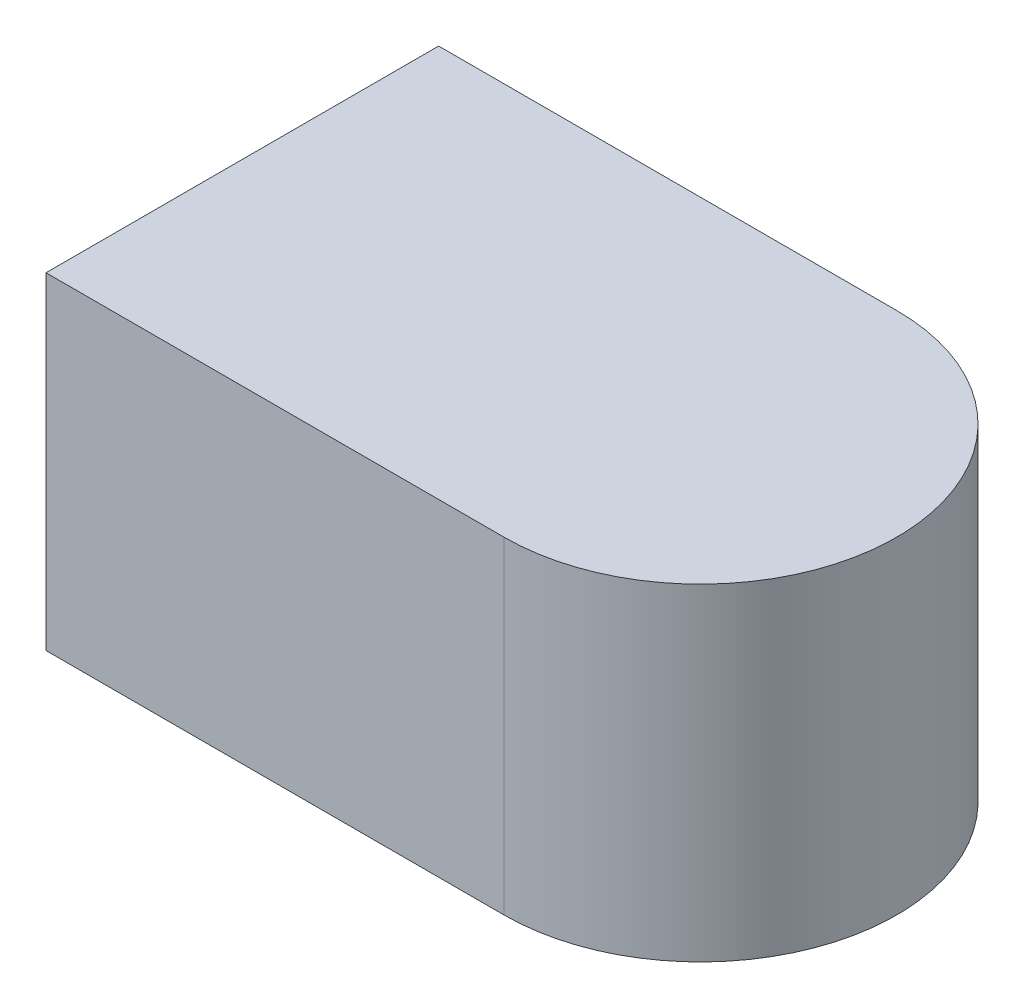
ISO-10303-21;
HEADER;
FILE_DESCRIPTION(('STEP AP214'),'2;1');
FILE_NAME('part.step','',(''),(''),'','','');
FILE_SCHEMA(('AUTOMOTIVE_DESIGN { 1 0 10303 214 1 1 1 1 }'));
ENDSEC;
DATA;
#1=APPLICATION_CONTEXT('core data for automotive mechanical design processes');
#2=APPLICATION_PROTOCOL_DEFINITION('international standard','automotive_design',2000,#1);
#3=PRODUCT_CONTEXT('',#1,'mechanical');
#4=PRODUCT('Part','Part','',(#3));
#5=PRODUCT_RELATED_PRODUCT_CATEGORY('part','',(#4));
#6=PRODUCT_DEFINITION_FORMATION('','',#4);
#7=PRODUCT_DEFINITION_CONTEXT('part definition',#1,'design');
#8=PRODUCT_DEFINITION('design','',#6,#7);
#9=PRODUCT_DEFINITION_SHAPE('','',#8);
#10=(LENGTH_UNIT() NAMED_UNIT(*) SI_UNIT(.MILLI.,.METRE.));
#11=(NAMED_UNIT(*) PLANE_ANGLE_UNIT() SI_UNIT($,.RADIAN.));
#12=(NAMED_UNIT(*) SI_UNIT($,.STERADIAN.) SOLID_ANGLE_UNIT());
#13=UNCERTAINTY_MEASURE_WITH_UNIT(LENGTH_MEASURE(1.E-05),#10,'distance_accuracy_value','');
#14=(GEOMETRIC_REPRESENTATION_CONTEXT(3) GLOBAL_UNCERTAINTY_ASSIGNED_CONTEXT((#13)) GLOBAL_UNIT_ASSIGNED_CONTEXT((#10,
#11,#12)) REPRESENTATION_CONTEXT('',''));
#15=CARTESIAN_POINT('',(0.,0.,0.));
#16=DIRECTION('',(0.,0.,1.));
#17=DIRECTION('',(1.,0.,0.));
#18=AXIS2_PLACEMENT_3D('',#15,#16,#17);
#19=CARTESIAN_POINT('',(0.,0.,0.));
#20=DIRECTION('',(0.,-1.,0.));
#21=DIRECTION('',(-1.,0.,0.));
#22=AXIS2_PLACEMENT_3D('',#19,#20,#21);
#23=PLANE('',#22);
#24=CARTESIAN_POINT('',(-1.47,0.,-1.25));
#25=DIRECTION('',(0.,-1.,0.));
#26=DIRECTION('',(0.,0.,-1.));
#27=AXIS2_PLACEMENT_3D('',#24,#25,#26);
#28=CIRCLE('',#27,0.12);
#29=CARTESIAN_POINT('',(-1.47,0.,-1.37));
#30=VERTEX_POINT('',#29);
#31=CARTESIAN_POINT('',(-1.47,0.,-1.13));
#32=VERTEX_POINT('',#31);
#33=EDGE_CURVE('E11',#30,#32,#28,.T.);
#34=ORIENTED_EDGE('',*,*,#33,.T.);
#35=DIRECTION('',(-1.,0.,0.));
#36=VECTOR('',#35,1.);
#37=CARTESIAN_POINT('',(-1.47,0.,-1.13));
#38=LINE('',#37,#36);
#39=CARTESIAN_POINT('',(-1.75,0.,-1.13));
#40=VERTEX_POINT('',#39);
#41=EDGE_CURVE('E24',#32,#40,#38,.T.);
#42=ORIENTED_EDGE('',*,*,#41,.T.);
#43=DIRECTION('',(0.,0.,-1.));
#44=VECTOR('',#43,1.);
#45=CARTESIAN_POINT('',(-1.75,0.,-1.13));
#46=LINE('',#45,#44);
#47=CARTESIAN_POINT('',(-1.75,0.,-1.37));
#48=VERTEX_POINT('',#47);
#49=EDGE_CURVE('E62',#40,#48,#46,.T.);
#50=ORIENTED_EDGE('',*,*,#49,.T.);
#51=DIRECTION('',(1.,0.,0.));
#52=VECTOR('',#51,1.);
#53=CARTESIAN_POINT('',(-1.75,0.,-1.37));
#54=LINE('',#53,#52);
#55=EDGE_CURVE('E36',#48,#30,#54,.T.);
#56=ORIENTED_EDGE('',*,*,#55,.T.);
#57=EDGE_LOOP('',(#34,#42,#50,#56));
#58=FACE_BOUND('',#57,.T.);
#59=ADVANCED_FACE('F17',(#58),#23,.T.);
#60=CARTESIAN_POINT('',(-1.75,0.,-1.37));
#61=DIRECTION('',(0.,0.,1.));
#62=DIRECTION('',(1.,0.,0.));
#63=AXIS2_PLACEMENT_3D('',#60,#61,#62);
#64=PLANE('',#63);
#65=DIRECTION('',(0.,1.,0.));
#66=VECTOR('',#65,1.);
#67=CARTESIAN_POINT('',(-1.75,0.,-1.37));
#68=LINE('',#67,#66);
#69=CARTESIAN_POINT('',(-1.75,0.2,-1.37));
#70=VERTEX_POINT('',#69);
#71=EDGE_CURVE('E84',#48,#70,#68,.T.);
#72=ORIENTED_EDGE('',*,*,#71,.T.);
#73=DIRECTION('',(1.,0.,0.));
#74=VECTOR('',#73,1.);
#75=CARTESIAN_POINT('',(-1.75,0.2,-1.37));
#76=LINE('',#75,#74);
#77=CARTESIAN_POINT('',(-1.47,0.2,-1.37));
#78=VERTEX_POINT('',#77);
#79=EDGE_CURVE('E74',#70,#78,#76,.T.);
#80=ORIENTED_EDGE('',*,*,#79,.T.);
#81=DIRECTION('',(0.,1.,0.));
#82=VECTOR('',#81,1.);
#83=CARTESIAN_POINT('',(-1.47,0.,-1.37));
#84=LINE('',#83,#82);
#85=EDGE_CURVE('E81',#30,#78,#84,.T.);
#86=ORIENTED_EDGE('',*,*,#85,.F.);
#87=ORIENTED_EDGE('',*,*,#55,.F.);
#88=EDGE_LOOP('',(#72,#80,#86,#87));
#89=FACE_BOUND('',#88,.T.);
#90=ADVANCED_FACE('F91',(#89),#64,.F.);
#91=CARTESIAN_POINT('',(-1.47,0.,-1.25));
#92=DIRECTION('',(0.,-1.,0.));
#93=DIRECTION('',(-1.,0.,0.));
#94=AXIS2_PLACEMENT_3D('',#91,#92,#93);
#95=CYLINDRICAL_SURFACE('',#94,0.12);
#96=ORIENTED_EDGE('',*,*,#85,.T.);
#97=CARTESIAN_POINT('',(-1.47,0.2,-1.25));
#98=DIRECTION('',(0.,-1.,0.));
#99=DIRECTION('',(0.,0.,-1.));
#100=AXIS2_PLACEMENT_3D('',#97,#98,#99);
#101=CIRCLE('',#100,0.12);
#102=CARTESIAN_POINT('',(-1.47,0.2,-1.13));
#103=VERTEX_POINT('',#102);
#104=EDGE_CURVE('E79',#78,#103,#101,.T.);
#105=ORIENTED_EDGE('',*,*,#104,.T.);
#106=DIRECTION('',(0.,1.,0.));
#107=VECTOR('',#106,1.);
#108=CARTESIAN_POINT('',(-1.47,0.,-1.13));
#109=LINE('',#108,#107);
#110=EDGE_CURVE('E68',#32,#103,#109,.T.);
#111=ORIENTED_EDGE('',*,*,#110,.F.);
#112=ORIENTED_EDGE('',*,*,#33,.F.);
#113=EDGE_LOOP('',(#96,#105,#111,#112));
#114=FACE_BOUND('',#113,.T.);
#115=ADVANCED_FACE('F89',(#114),#95,.T.);
#116=CARTESIAN_POINT('',(-1.47,0.,-1.13));
#117=DIRECTION('',(0.,0.,-1.));
#118=DIRECTION('',(-1.,0.,0.));
#119=AXIS2_PLACEMENT_3D('',#116,#117,#118);
#120=PLANE('',#119);
#121=ORIENTED_EDGE('',*,*,#110,.T.);
#122=DIRECTION('',(-1.,0.,0.));
#123=VECTOR('',#122,1.);
#124=CARTESIAN_POINT('',(-1.47,0.2,-1.13));
#125=LINE('',#124,#123);
#126=CARTESIAN_POINT('',(-1.75,0.2,-1.13));
#127=VERTEX_POINT('',#126);
#128=EDGE_CURVE('E63',#103,#127,#125,.T.);
#129=ORIENTED_EDGE('',*,*,#128,.T.);
#130=DIRECTION('',(0.,1.,0.));
#131=VECTOR('',#130,1.);
#132=CARTESIAN_POINT('',(-1.75,0.,-1.13));
#133=LINE('',#132,#131);
#134=EDGE_CURVE('E56',#40,#127,#133,.T.);
#135=ORIENTED_EDGE('',*,*,#134,.F.);
#136=ORIENTED_EDGE('',*,*,#41,.F.);
#137=EDGE_LOOP('',(#121,#129,#135,#136));
#138=FACE_BOUND('',#137,.T.);
#139=ADVANCED_FACE('F66',(#138),#120,.F.);
#140=CARTESIAN_POINT('',(-1.75,0.,-1.13));
#141=DIRECTION('',(1.,0.,0.));
#142=DIRECTION('',(0.,0.,-1.));
#143=AXIS2_PLACEMENT_3D('',#140,#141,#142);
#144=PLANE('',#143);
#145=ORIENTED_EDGE('',*,*,#134,.T.);
#146=DIRECTION('',(0.,0.,-1.));
#147=VECTOR('',#146,1.);
#148=CARTESIAN_POINT('',(-1.75,0.2,-1.13));
#149=LINE('',#148,#147);
#150=EDGE_CURVE('E61',#127,#70,#149,.T.);
#151=ORIENTED_EDGE('',*,*,#150,.T.);
#152=ORIENTED_EDGE('',*,*,#71,.F.);
#153=ORIENTED_EDGE('',*,*,#49,.F.);
#154=EDGE_LOOP('',(#145,#151,#152,#153));
#155=FACE_BOUND('',#154,.T.);
#156=ADVANCED_FACE('F58',(#155),#144,.F.);
#157=CARTESIAN_POINT('',(0.,0.2,0.));
#158=DIRECTION('',(0.,-1.,0.));
#159=DIRECTION('',(-1.,0.,0.));
#160=AXIS2_PLACEMENT_3D('',#157,#158,#159);
#161=PLANE('',#160);
#162=ORIENTED_EDGE('',*,*,#150,.F.);
#163=ORIENTED_EDGE('',*,*,#128,.F.);
#164=ORIENTED_EDGE('',*,*,#104,.F.);
#165=ORIENTED_EDGE('',*,*,#79,.F.);
#166=EDGE_LOOP('',(#162,#163,#164,#165));
#167=FACE_BOUND('',#166,.T.);
#168=ADVANCED_FACE('F72',(#167),#161,.F.);
#169=CLOSED_SHELL('',(#59,#90,#115,#139,#156,#168));
#170=MANIFOLD_SOLID_BREP('B1',#169);
#171=ADVANCED_BREP_SHAPE_REPRESENTATION('',(#18,#170),#14);
#172=SHAPE_DEFINITION_REPRESENTATION(#9,#171);
ENDSEC;
END-ISO-10303-21;
